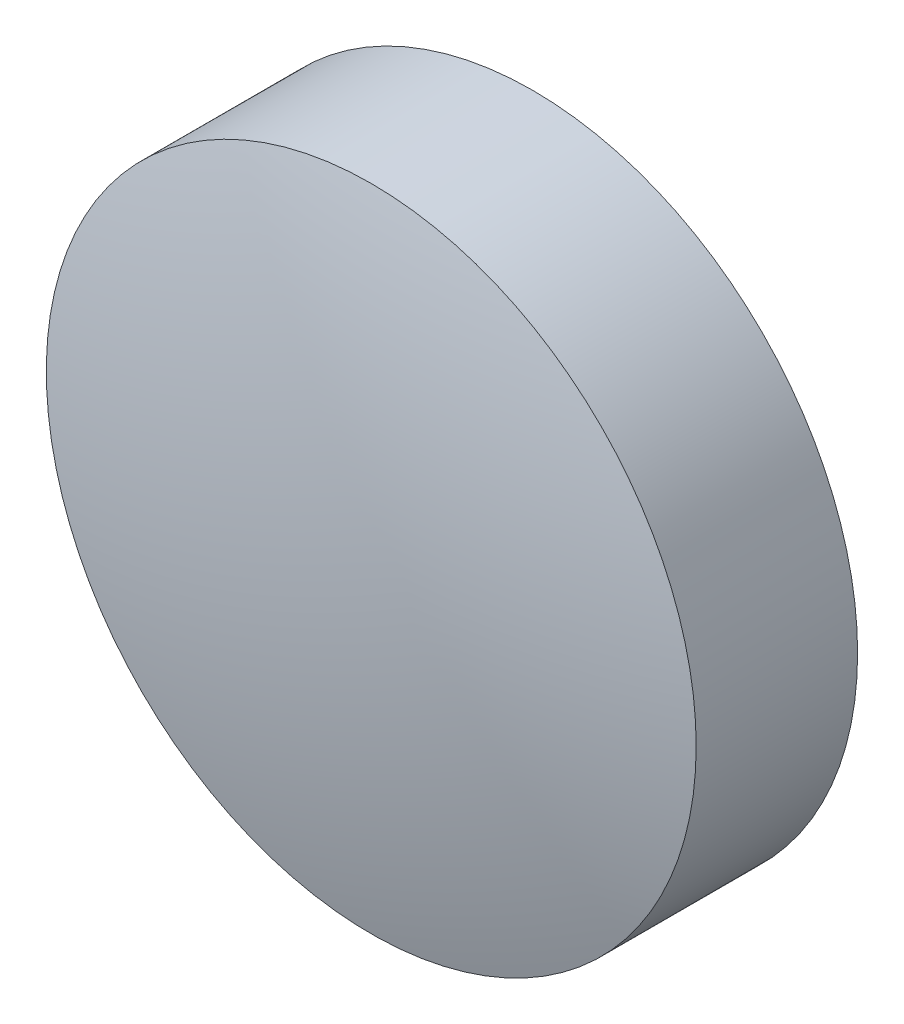
ISO-10303-21;
HEADER;
FILE_DESCRIPTION(('STEP AP214'),'2;1');
FILE_NAME('part.step','',(''),(''),'','','');
FILE_SCHEMA(('AUTOMOTIVE_DESIGN { 1 0 10303 214 1 1 1 1 }'));
ENDSEC;
DATA;
#1=APPLICATION_CONTEXT('core data for automotive mechanical design processes');
#2=APPLICATION_PROTOCOL_DEFINITION('international standard','automotive_design',2000,#1);
#3=PRODUCT_CONTEXT('',#1,'mechanical');
#4=PRODUCT('Part','Part','',(#3));
#5=PRODUCT_RELATED_PRODUCT_CATEGORY('part','',(#4));
#6=PRODUCT_DEFINITION_FORMATION('','',#4);
#7=PRODUCT_DEFINITION_CONTEXT('part definition',#1,'design');
#8=PRODUCT_DEFINITION('design','',#6,#7);
#9=PRODUCT_DEFINITION_SHAPE('','',#8);
#10=(LENGTH_UNIT() NAMED_UNIT(*) SI_UNIT(.MILLI.,.METRE.));
#11=(NAMED_UNIT(*) PLANE_ANGLE_UNIT() SI_UNIT($,.RADIAN.));
#12=(NAMED_UNIT(*) SI_UNIT($,.STERADIAN.) SOLID_ANGLE_UNIT());
#13=UNCERTAINTY_MEASURE_WITH_UNIT(LENGTH_MEASURE(1.E-05),#10,'distance_accuracy_value','');
#14=(GEOMETRIC_REPRESENTATION_CONTEXT(3) GLOBAL_UNCERTAINTY_ASSIGNED_CONTEXT((#13)) GLOBAL_UNIT_ASSIGNED_CONTEXT((#10,
#11,#12)) REPRESENTATION_CONTEXT('',''));
#15=CARTESIAN_POINT('',(0.,0.,0.));
#16=DIRECTION('',(0.,0.,1.));
#17=DIRECTION('',(1.,0.,0.));
#18=AXIS2_PLACEMENT_3D('',#15,#16,#17);
#19=CARTESIAN_POINT('',(0.,0.,-22.13));
#20=DIRECTION('',(0.,0.,1.));
#21=DIRECTION('',(0.,1.,0.));
#22=AXIS2_PLACEMENT_3D('',#19,#20,#21);
#23=SPHERICAL_SURFACE('',#22,24.28);
#24=CARTESIAN_POINT('',(0.,0.,1.33179660639825));
#25=DIRECTION('',(0.,0.,1.));
#26=DIRECTION('',(1.,0.,0.));
#27=AXIS2_PLACEMENT_3D('',#24,#25,#26);
#28=CIRCLE('',#27,6.25);
#29=CARTESIAN_POINT('',(6.25,0.,1.33179660639825));
#30=VERTEX_POINT('',#29);
#31=EDGE_CURVE('E36',#30,#30,#28,.T.);
#32=ORIENTED_EDGE('',*,*,#31,.T.);
#33=EDGE_LOOP('',(#32));
#34=FACE_BOUND('',#33,.T.);
#35=ADVANCED_FACE('F30',(#34),#23,.T.);
#36=CARTESIAN_POINT('',(0.,0.,49.85));
#37=DIRECTION('',(0.,0.,1.));
#38=DIRECTION('',(0.,1.,0.));
#39=AXIS2_PLACEMENT_3D('',#36,#37,#38);
#40=SPHERICAL_SURFACE('',#39,52.);
#41=CARTESIAN_POINT('',(0.,0.,-1.77303265016499));
#42=DIRECTION('',(0.,0.,1.));
#43=DIRECTION('',(1.,0.,0.));
#44=AXIS2_PLACEMENT_3D('',#41,#42,#43);
#45=CIRCLE('',#44,6.25);
#46=CARTESIAN_POINT('',(6.25,0.,-1.77303265016499));
#47=VERTEX_POINT('',#46);
#48=EDGE_CURVE('E10',#47,#47,#45,.T.);
#49=ORIENTED_EDGE('',*,*,#48,.F.);
#50=EDGE_LOOP('',(#49));
#51=FACE_BOUND('',#50,.T.);
#52=ADVANCED_FACE('F45',(#51),#40,.T.);
#53=CARTESIAN_POINT('',(0.,0.,65.3538766706384));
#54=DIRECTION('',(0.,0.,1.));
#55=DIRECTION('',(1.,0.,0.));
#56=AXIS2_PLACEMENT_3D('',#53,#54,#55);
#57=CYLINDRICAL_SURFACE('',#56,6.25);
#58=ORIENTED_EDGE('',*,*,#31,.F.);
#59=EDGE_LOOP('',(#58));
#60=FACE_BOUND('',#59,.T.);
#61=ORIENTED_EDGE('',*,*,#48,.T.);
#62=EDGE_LOOP('',(#61));
#63=FACE_BOUND('',#62,.T.);
#64=ADVANCED_FACE('F43',(#60,#63),#57,.T.);
#65=CLOSED_SHELL('',(#35,#52,#64));
#66=MANIFOLD_SOLID_BREP('B2',#65);
#67=ADVANCED_BREP_SHAPE_REPRESENTATION('',(#18,#66),#14);
#68=SHAPE_DEFINITION_REPRESENTATION(#9,#67);
ENDSEC;
END-ISO-10303-21;
